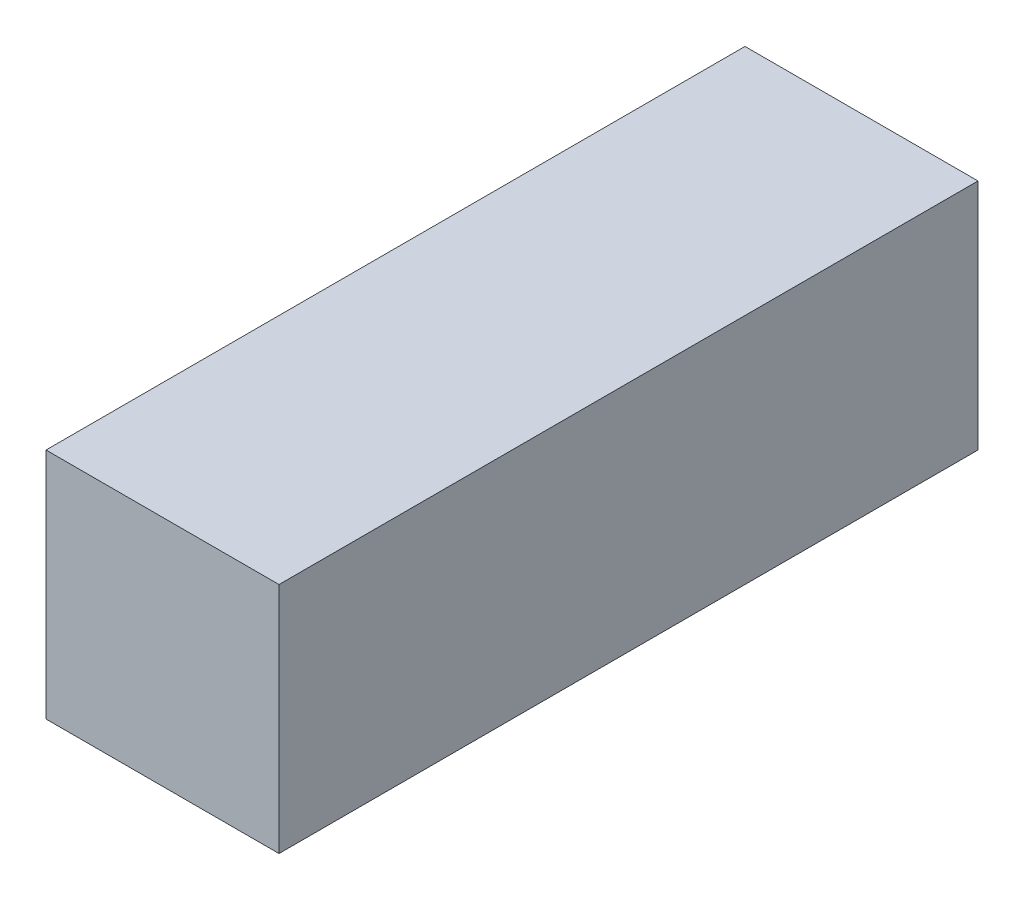
ISO-10303-21;
HEADER;
FILE_DESCRIPTION(('STEP AP214'),'2;1');
FILE_NAME('part.step','',(''),(''),'','','');
FILE_SCHEMA(('AUTOMOTIVE_DESIGN { 1 0 10303 214 1 1 1 1 }'));
ENDSEC;
DATA;
#1=APPLICATION_CONTEXT('core data for automotive mechanical design processes');
#2=APPLICATION_PROTOCOL_DEFINITION('international standard','automotive_design',2000,#1);
#3=PRODUCT_CONTEXT('',#1,'mechanical');
#4=PRODUCT('Part','Part','',(#3));
#5=PRODUCT_RELATED_PRODUCT_CATEGORY('part','',(#4));
#6=PRODUCT_DEFINITION_FORMATION('','',#4);
#7=PRODUCT_DEFINITION_CONTEXT('part definition',#1,'design');
#8=PRODUCT_DEFINITION('design','',#6,#7);
#9=PRODUCT_DEFINITION_SHAPE('','',#8);
#10=(LENGTH_UNIT() NAMED_UNIT(*) SI_UNIT(.MILLI.,.METRE.));
#11=(NAMED_UNIT(*) PLANE_ANGLE_UNIT() SI_UNIT($,.RADIAN.));
#12=(NAMED_UNIT(*) SI_UNIT($,.STERADIAN.) SOLID_ANGLE_UNIT());
#13=UNCERTAINTY_MEASURE_WITH_UNIT(LENGTH_MEASURE(1.E-05),#10,'distance_accuracy_value','');
#14=(GEOMETRIC_REPRESENTATION_CONTEXT(3) GLOBAL_UNCERTAINTY_ASSIGNED_CONTEXT((#13)) GLOBAL_UNIT_ASSIGNED_CONTEXT((#10,
#11,#12)) REPRESENTATION_CONTEXT('',''));
#15=CARTESIAN_POINT('',(0.,0.,0.));
#16=DIRECTION('',(0.,0.,1.));
#17=DIRECTION('',(1.,0.,0.));
#18=AXIS2_PLACEMENT_3D('',#15,#16,#17);
#19=CARTESIAN_POINT('',(1.5875,-1.5875,9.525));
#20=DIRECTION('',(-1.,0.,0.));
#21=DIRECTION('',(0.,0.,1.));
#22=AXIS2_PLACEMENT_3D('',#19,#20,#21);
#23=PLANE('',#22);
#24=DIRECTION('',(0.,1.,0.));
#25=VECTOR('',#24,1.);
#26=CARTESIAN_POINT('',(1.5875,-1.5875,0.));
#27=LINE('',#26,#25);
#28=CARTESIAN_POINT('',(1.5875,-1.5875,0.));
#29=VERTEX_POINT('',#28);
#30=CARTESIAN_POINT('',(1.5875,1.5875,0.));
#31=VERTEX_POINT('',#30);
#32=EDGE_CURVE('E111',#29,#31,#27,.T.);
#33=ORIENTED_EDGE('',*,*,#32,.T.);
#34=DIRECTION('',(0.,0.,-1.));
#35=VECTOR('',#34,1.);
#36=CARTESIAN_POINT('',(1.5875,1.5875,9.525));
#37=LINE('',#36,#35);
#38=CARTESIAN_POINT('',(1.5875,1.5875,9.525));
#39=VERTEX_POINT('',#38);
#40=EDGE_CURVE('E11',#39,#31,#37,.T.);
#41=ORIENTED_EDGE('',*,*,#40,.F.);
#42=DIRECTION('',(0.,1.,0.));
#43=VECTOR('',#42,1.);
#44=CARTESIAN_POINT('',(1.5875,-1.5875,9.525));
#45=LINE('',#44,#43);
#46=CARTESIAN_POINT('',(1.5875,-1.5875,9.525));
#47=VERTEX_POINT('',#46);
#48=EDGE_CURVE('E95',#47,#39,#45,.T.);
#49=ORIENTED_EDGE('',*,*,#48,.F.);
#50=DIRECTION('',(0.,0.,-1.));
#51=VECTOR('',#50,1.);
#52=CARTESIAN_POINT('',(1.5875,-1.5875,9.525));
#53=LINE('',#52,#51);
#54=EDGE_CURVE('E107',#47,#29,#53,.T.);
#55=ORIENTED_EDGE('',*,*,#54,.T.);
#56=EDGE_LOOP('',(#33,#41,#49,#55));
#57=FACE_BOUND('',#56,.T.);
#58=ADVANCED_FACE('F43',(#57),#23,.F.);
#59=CARTESIAN_POINT('',(-1.5875,1.5875,9.525));
#60=DIRECTION('',(0.,-1.,0.));
#61=DIRECTION('',(0.,0.,-1.));
#62=AXIS2_PLACEMENT_3D('',#59,#60,#61);
#63=PLANE('',#62);
#64=DIRECTION('',(-1.,0.,0.));
#65=VECTOR('',#64,1.);
#66=CARTESIAN_POINT('',(-1.5875,1.5875,0.));
#67=LINE('',#66,#65);
#68=CARTESIAN_POINT('',(-1.5875,1.5875,0.));
#69=VERTEX_POINT('',#68);
#70=EDGE_CURVE('E100',#31,#69,#67,.T.);
#71=ORIENTED_EDGE('',*,*,#70,.T.);
#72=DIRECTION('',(0.,0.,-1.));
#73=VECTOR('',#72,1.);
#74=CARTESIAN_POINT('',(-1.5875,1.5875,9.525));
#75=LINE('',#74,#73);
#76=CARTESIAN_POINT('',(-1.5875,1.5875,9.525));
#77=VERTEX_POINT('',#76);
#78=EDGE_CURVE('E52',#77,#69,#75,.T.);
#79=ORIENTED_EDGE('',*,*,#78,.F.);
#80=DIRECTION('',(-1.,0.,0.));
#81=VECTOR('',#80,1.);
#82=CARTESIAN_POINT('',(-1.5875,1.5875,9.525));
#83=LINE('',#82,#81);
#84=EDGE_CURVE('E90',#39,#77,#83,.T.);
#85=ORIENTED_EDGE('',*,*,#84,.F.);
#86=ORIENTED_EDGE('',*,*,#40,.T.);
#87=EDGE_LOOP('',(#71,#79,#85,#86));
#88=FACE_BOUND('',#87,.T.);
#89=ADVANCED_FACE('F99',(#88),#63,.F.);
#90=CARTESIAN_POINT('',(-1.5875,-1.5875,9.525));
#91=DIRECTION('',(1.,0.,0.));
#92=DIRECTION('',(0.,0.,-1.));
#93=AXIS2_PLACEMENT_3D('',#90,#91,#92);
#94=PLANE('',#93);
#95=DIRECTION('',(0.,-1.,0.));
#96=VECTOR('',#95,1.);
#97=CARTESIAN_POINT('',(-1.5875,-1.5875,0.));
#98=LINE('',#97,#96);
#99=CARTESIAN_POINT('',(-1.5875,-1.5875,0.));
#100=VERTEX_POINT('',#99);
#101=EDGE_CURVE('E77',#69,#100,#98,.T.);
#102=ORIENTED_EDGE('',*,*,#101,.T.);
#103=DIRECTION('',(0.,0.,-1.));
#104=VECTOR('',#103,1.);
#105=CARTESIAN_POINT('',(-1.5875,-1.5875,9.525));
#106=LINE('',#105,#104);
#107=CARTESIAN_POINT('',(-1.5875,-1.5875,9.525));
#108=VERTEX_POINT('',#107);
#109=EDGE_CURVE('E102',#108,#100,#106,.T.);
#110=ORIENTED_EDGE('',*,*,#109,.F.);
#111=DIRECTION('',(0.,-1.,0.));
#112=VECTOR('',#111,1.);
#113=CARTESIAN_POINT('',(-1.5875,-1.5875,9.525));
#114=LINE('',#113,#112);
#115=EDGE_CURVE('E93',#77,#108,#114,.T.);
#116=ORIENTED_EDGE('',*,*,#115,.F.);
#117=ORIENTED_EDGE('',*,*,#78,.T.);
#118=EDGE_LOOP('',(#102,#110,#116,#117));
#119=FACE_BOUND('',#118,.T.);
#120=ADVANCED_FACE('F103',(#119),#94,.F.);
#121=CARTESIAN_POINT('',(-1.5875,-1.5875,9.525));
#122=DIRECTION('',(0.,1.,0.));
#123=DIRECTION('',(0.,0.,1.));
#124=AXIS2_PLACEMENT_3D('',#121,#122,#123);
#125=PLANE('',#124);
#126=DIRECTION('',(1.,0.,0.));
#127=VECTOR('',#126,1.);
#128=CARTESIAN_POINT('',(-1.5875,-1.5875,0.));
#129=LINE('',#128,#127);
#130=EDGE_CURVE('E83',#100,#29,#129,.T.);
#131=ORIENTED_EDGE('',*,*,#130,.T.);
#132=ORIENTED_EDGE('',*,*,#54,.F.);
#133=DIRECTION('',(1.,0.,0.));
#134=VECTOR('',#133,1.);
#135=CARTESIAN_POINT('',(-1.5875,-1.5875,9.525));
#136=LINE('',#135,#134);
#137=EDGE_CURVE('E60',#108,#47,#136,.T.);
#138=ORIENTED_EDGE('',*,*,#137,.F.);
#139=ORIENTED_EDGE('',*,*,#109,.T.);
#140=EDGE_LOOP('',(#131,#132,#138,#139));
#141=FACE_BOUND('',#140,.T.);
#142=ADVANCED_FACE('F124',(#141),#125,.F.);
#143=CARTESIAN_POINT('',(0.,0.,9.525));
#144=DIRECTION('',(0.,0.,-1.));
#145=DIRECTION('',(-1.,0.,0.));
#146=AXIS2_PLACEMENT_3D('',#143,#144,#145);
#147=PLANE('',#146);
#148=ORIENTED_EDGE('',*,*,#48,.T.);
#149=ORIENTED_EDGE('',*,*,#84,.T.);
#150=ORIENTED_EDGE('',*,*,#115,.T.);
#151=ORIENTED_EDGE('',*,*,#137,.T.);
#152=EDGE_LOOP('',(#148,#149,#150,#151));
#153=FACE_BOUND('',#152,.T.);
#154=ADVANCED_FACE('F91',(#153),#147,.F.);
#155=CARTESIAN_POINT('',(0.,0.,0.));
#156=DIRECTION('',(0.,0.,-1.));
#157=DIRECTION('',(-1.,0.,0.));
#158=AXIS2_PLACEMENT_3D('',#155,#156,#157);
#159=PLANE('',#158);
#160=ORIENTED_EDGE('',*,*,#32,.F.);
#161=ORIENTED_EDGE('',*,*,#130,.F.);
#162=ORIENTED_EDGE('',*,*,#101,.F.);
#163=ORIENTED_EDGE('',*,*,#70,.F.);
#164=EDGE_LOOP('',(#160,#161,#162,#163));
#165=FACE_BOUND('',#164,.T.);
#166=ADVANCED_FACE('F127',(#165),#159,.T.);
#167=CLOSED_SHELL('',(#58,#89,#120,#142,#154,#166));
#168=MANIFOLD_SOLID_BREP('B2',#167);
#169=ADVANCED_BREP_SHAPE_REPRESENTATION('',(#18,#168),#14);
#170=SHAPE_DEFINITION_REPRESENTATION(#9,#169);
ENDSEC;
END-ISO-10303-21;
